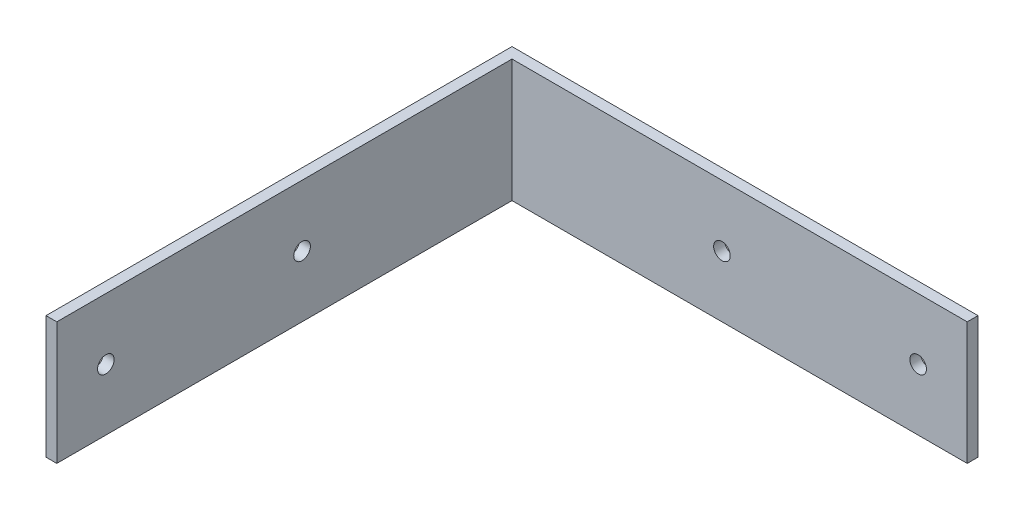
ISO-10303-21;
HEADER;
FILE_DESCRIPTION(('STEP AP214'),'2;1');
FILE_NAME('part.step','',(''),(''),'','','');
FILE_SCHEMA(('AUTOMOTIVE_DESIGN { 1 0 10303 214 1 1 1 1 }'));
ENDSEC;
DATA;
#1=APPLICATION_CONTEXT('core data for automotive mechanical design processes');
#2=APPLICATION_PROTOCOL_DEFINITION('international standard','automotive_design',2000,#1);
#3=PRODUCT_CONTEXT('',#1,'mechanical');
#4=PRODUCT('Part','Part','',(#3));
#5=PRODUCT_RELATED_PRODUCT_CATEGORY('part','',(#4));
#6=PRODUCT_DEFINITION_FORMATION('','',#4);
#7=PRODUCT_DEFINITION_CONTEXT('part definition',#1,'design');
#8=PRODUCT_DEFINITION('design','',#6,#7);
#9=PRODUCT_DEFINITION_SHAPE('','',#8);
#10=(LENGTH_UNIT() NAMED_UNIT(*) SI_UNIT(.MILLI.,.METRE.));
#11=(NAMED_UNIT(*) PLANE_ANGLE_UNIT() SI_UNIT($,.RADIAN.));
#12=(NAMED_UNIT(*) SI_UNIT($,.STERADIAN.) SOLID_ANGLE_UNIT());
#13=UNCERTAINTY_MEASURE_WITH_UNIT(LENGTH_MEASURE(1.E-05),#10,'distance_accuracy_value','');
#14=(GEOMETRIC_REPRESENTATION_CONTEXT(3) GLOBAL_UNCERTAINTY_ASSIGNED_CONTEXT((#13)) GLOBAL_UNIT_ASSIGNED_CONTEXT((#10,
#11,#12)) REPRESENTATION_CONTEXT('',''));
#15=CARTESIAN_POINT('',(0.,0.,0.));
#16=DIRECTION('',(0.,0.,1.));
#17=DIRECTION('',(1.,0.,0.));
#18=AXIS2_PLACEMENT_3D('',#15,#16,#17);
#19=CARTESIAN_POINT('',(120.65,31.75,0.));
#20=DIRECTION('',(-1.,0.,0.));
#21=DIRECTION('',(0.,0.,1.));
#22=AXIS2_PLACEMENT_3D('',#19,#20,#21);
#23=PLANE('',#22);
#24=DIRECTION('',(0.,0.,-1.));
#25=VECTOR('',#24,1.);
#26=CARTESIAN_POINT('',(120.65,0.,0.));
#27=LINE('',#26,#25);
#28=CARTESIAN_POINT('',(120.65,0.,2.794));
#29=VERTEX_POINT('',#28);
#30=CARTESIAN_POINT('',(120.65,0.,0.));
#31=VERTEX_POINT('',#30);
#32=EDGE_CURVE('E142',#29,#31,#27,.T.);
#33=ORIENTED_EDGE('',*,*,#32,.T.);
#34=DIRECTION('',(0.,-1.,0.));
#35=VECTOR('',#34,1.);
#36=CARTESIAN_POINT('',(120.65,31.75,0.));
#37=LINE('',#36,#35);
#38=CARTESIAN_POINT('',(120.65,31.75,0.));
#39=VERTEX_POINT('',#38);
#40=EDGE_CURVE('E11',#39,#31,#37,.T.);
#41=ORIENTED_EDGE('',*,*,#40,.F.);
#42=DIRECTION('',(0.,0.,-1.));
#43=VECTOR('',#42,1.);
#44=CARTESIAN_POINT('',(120.65,31.75,0.));
#45=LINE('',#44,#43);
#46=CARTESIAN_POINT('',(120.65,31.75,2.794));
#47=VERTEX_POINT('',#46);
#48=EDGE_CURVE('E159',#47,#39,#45,.T.);
#49=ORIENTED_EDGE('',*,*,#48,.F.);
#50=DIRECTION('',(0.,-1.,0.));
#51=VECTOR('',#50,1.);
#52=CARTESIAN_POINT('',(120.65,31.75,2.794));
#53=LINE('',#52,#51);
#54=EDGE_CURVE('E138',#47,#29,#53,.T.);
#55=ORIENTED_EDGE('',*,*,#54,.T.);
#56=EDGE_LOOP('',(#33,#41,#49,#55));
#57=FACE_BOUND('',#56,.T.);
#58=ADVANCED_FACE('F38',(#57),#23,.F.);
#59=CARTESIAN_POINT('',(0.,31.75,0.));
#60=DIRECTION('',(0.,0.,1.));
#61=DIRECTION('',(1.,0.,0.));
#62=AXIS2_PLACEMENT_3D('',#59,#60,#61);
#63=PLANE('',#62);
#64=CARTESIAN_POINT('',(107.95,15.875,0.));
#65=DIRECTION('',(0.,0.,-1.));
#66=DIRECTION('',(-1.,0.,0.));
#67=AXIS2_PLACEMENT_3D('',#64,#65,#66);
#68=CIRCLE('',#67,2.15264999999999);
#69=CARTESIAN_POINT('',(105.79735,15.875,0.));
#70=VERTEX_POINT('',#69);
#71=EDGE_CURVE('E328',#70,#70,#68,.T.);
#72=ORIENTED_EDGE('',*,*,#71,.F.);
#73=EDGE_LOOP('',(#72));
#74=FACE_BOUND('',#73,.T.);
#75=CARTESIAN_POINT('',(57.15,15.875,0.));
#76=DIRECTION('',(0.,0.,-1.));
#77=DIRECTION('',(-1.,0.,0.));
#78=AXIS2_PLACEMENT_3D('',#75,#76,#77);
#79=CIRCLE('',#78,2.15265);
#80=CARTESIAN_POINT('',(54.99735,15.875,0.));
#81=VERTEX_POINT('',#80);
#82=EDGE_CURVE('E299',#81,#81,#79,.T.);
#83=ORIENTED_EDGE('',*,*,#82,.F.);
#84=EDGE_LOOP('',(#83));
#85=FACE_BOUND('',#84,.T.);
#86=DIRECTION('',(-1.,0.,0.));
#87=VECTOR('',#86,1.);
#88=CARTESIAN_POINT('',(0.,0.,0.));
#89=LINE('',#88,#87);
#90=CARTESIAN_POINT('',(0.,0.,0.));
#91=VERTEX_POINT('',#90);
#92=EDGE_CURVE('E146',#31,#91,#89,.T.);
#93=ORIENTED_EDGE('',*,*,#92,.T.);
#94=DIRECTION('',(0.,-1.,0.));
#95=VECTOR('',#94,1.);
#96=CARTESIAN_POINT('',(0.,31.75,0.));
#97=LINE('',#96,#95);
#98=CARTESIAN_POINT('',(0.,31.75,0.));
#99=VERTEX_POINT('',#98);
#100=EDGE_CURVE('E48',#99,#91,#97,.T.);
#101=ORIENTED_EDGE('',*,*,#100,.F.);
#102=DIRECTION('',(-1.,0.,0.));
#103=VECTOR('',#102,1.);
#104=CARTESIAN_POINT('',(0.,31.75,0.));
#105=LINE('',#104,#103);
#106=EDGE_CURVE('E102',#39,#99,#105,.T.);
#107=ORIENTED_EDGE('',*,*,#106,.F.);
#108=ORIENTED_EDGE('',*,*,#40,.T.);
#109=EDGE_LOOP('',(#93,#101,#107,#108));
#110=FACE_BOUND('',#109,.T.);
#111=ADVANCED_FACE('F191',(#74,#85,#110),#63,.F.);
#112=CARTESIAN_POINT('',(0.,31.75,0.));
#113=DIRECTION('',(1.,0.,0.));
#114=DIRECTION('',(0.,0.,-1.));
#115=AXIS2_PLACEMENT_3D('',#112,#113,#114);
#116=PLANE('',#115);
#117=CARTESIAN_POINT('',(0.,15.875,107.95));
#118=DIRECTION('',(-1.,0.,0.));
#119=DIRECTION('',(0.,0.,1.));
#120=AXIS2_PLACEMENT_3D('',#117,#118,#119);
#121=CIRCLE('',#120,2.15264999999999);
#122=CARTESIAN_POINT('',(0.,15.875,110.10265));
#123=VERTEX_POINT('',#122);
#124=EDGE_CURVE('E312',#123,#123,#121,.T.);
#125=ORIENTED_EDGE('',*,*,#124,.F.);
#126=EDGE_LOOP('',(#125));
#127=FACE_BOUND('',#126,.T.);
#128=CARTESIAN_POINT('',(0.,15.875,57.15));
#129=DIRECTION('',(-1.,0.,0.));
#130=DIRECTION('',(0.,0.,1.));
#131=AXIS2_PLACEMENT_3D('',#128,#129,#130);
#132=CIRCLE('',#131,2.15264999999999);
#133=CARTESIAN_POINT('',(0.,15.875,59.30265));
#134=VERTEX_POINT('',#133);
#135=EDGE_CURVE('E318',#134,#134,#132,.T.);
#136=ORIENTED_EDGE('',*,*,#135,.F.);
#137=EDGE_LOOP('',(#136));
#138=FACE_BOUND('',#137,.T.);
#139=DIRECTION('',(0.,0.,1.));
#140=VECTOR('',#139,1.);
#141=CARTESIAN_POINT('',(0.,0.,0.));
#142=LINE('',#141,#140);
#143=CARTESIAN_POINT('',(0.,0.,120.65));
#144=VERTEX_POINT('',#143);
#145=EDGE_CURVE('E150',#91,#144,#142,.T.);
#146=ORIENTED_EDGE('',*,*,#145,.T.);
#147=DIRECTION('',(0.,-1.,0.));
#148=VECTOR('',#147,1.);
#149=CARTESIAN_POINT('',(0.,31.75,120.65));
#150=LINE('',#149,#148);
#151=CARTESIAN_POINT('',(0.,31.75,120.65));
#152=VERTEX_POINT('',#151);
#153=EDGE_CURVE('E129',#152,#144,#150,.T.);
#154=ORIENTED_EDGE('',*,*,#153,.F.);
#155=DIRECTION('',(0.,0.,1.));
#156=VECTOR('',#155,1.);
#157=CARTESIAN_POINT('',(0.,31.75,0.));
#158=LINE('',#157,#156);
#159=EDGE_CURVE('E118',#99,#152,#158,.T.);
#160=ORIENTED_EDGE('',*,*,#159,.F.);
#161=ORIENTED_EDGE('',*,*,#100,.T.);
#162=EDGE_LOOP('',(#146,#154,#160,#161));
#163=FACE_BOUND('',#162,.T.);
#164=ADVANCED_FACE('F169',(#127,#138,#163),#116,.F.);
#165=CARTESIAN_POINT('',(0.,31.75,120.65));
#166=DIRECTION('',(0.,0.,-1.));
#167=DIRECTION('',(-1.,0.,0.));
#168=AXIS2_PLACEMENT_3D('',#165,#166,#167);
#169=PLANE('',#168);
#170=DIRECTION('',(1.,0.,0.));
#171=VECTOR('',#170,1.);
#172=CARTESIAN_POINT('',(0.,0.,120.65));
#173=LINE('',#172,#171);
#174=CARTESIAN_POINT('',(2.79400000000001,0.,120.65));
#175=VERTEX_POINT('',#174);
#176=EDGE_CURVE('E127',#144,#175,#173,.T.);
#177=ORIENTED_EDGE('',*,*,#176,.T.);
#178=DIRECTION('',(0.,-1.,0.));
#179=VECTOR('',#178,1.);
#180=CARTESIAN_POINT('',(2.79400000000001,31.75,120.65));
#181=LINE('',#180,#179);
#182=CARTESIAN_POINT('',(2.79400000000001,31.75,120.65));
#183=VERTEX_POINT('',#182);
#184=EDGE_CURVE('E124',#183,#175,#181,.T.);
#185=ORIENTED_EDGE('',*,*,#184,.F.);
#186=DIRECTION('',(1.,0.,0.));
#187=VECTOR('',#186,1.);
#188=CARTESIAN_POINT('',(0.,31.75,120.65));
#189=LINE('',#188,#187);
#190=EDGE_CURVE('E112',#152,#183,#189,.T.);
#191=ORIENTED_EDGE('',*,*,#190,.F.);
#192=ORIENTED_EDGE('',*,*,#153,.T.);
#193=EDGE_LOOP('',(#177,#185,#191,#192));
#194=FACE_BOUND('',#193,.T.);
#195=ADVANCED_FACE('F125',(#194),#169,.F.);
#196=CARTESIAN_POINT('',(2.794,31.75,2.794));
#197=DIRECTION('',(-1.,0.,0.));
#198=DIRECTION('',(0.,0.,1.));
#199=AXIS2_PLACEMENT_3D('',#196,#197,#198);
#200=PLANE('',#199);
#201=CARTESIAN_POINT('',(2.79400000000001,15.875,107.95));
#202=DIRECTION('',(-1.,0.,0.));
#203=DIRECTION('',(0.,0.,1.));
#204=AXIS2_PLACEMENT_3D('',#201,#202,#203);
#205=CIRCLE('',#204,2.15264999999999);
#206=CARTESIAN_POINT('',(2.79400000000001,15.875,110.10265));
#207=VERTEX_POINT('',#206);
#208=EDGE_CURVE('E315',#207,#207,#205,.T.);
#209=ORIENTED_EDGE('',*,*,#208,.T.);
#210=EDGE_LOOP('',(#209));
#211=FACE_BOUND('',#210,.T.);
#212=CARTESIAN_POINT('',(2.794,15.875,57.15));
#213=DIRECTION('',(-1.,0.,0.));
#214=DIRECTION('',(0.,0.,1.));
#215=AXIS2_PLACEMENT_3D('',#212,#213,#214);
#216=CIRCLE('',#215,2.15264999999999);
#217=CARTESIAN_POINT('',(2.794,15.875,59.30265));
#218=VERTEX_POINT('',#217);
#219=EDGE_CURVE('E323',#218,#218,#216,.T.);
#220=ORIENTED_EDGE('',*,*,#219,.T.);
#221=EDGE_LOOP('',(#220));
#222=FACE_BOUND('',#221,.T.);
#223=DIRECTION('',(0.,0.,-1.));
#224=VECTOR('',#223,1.);
#225=CARTESIAN_POINT('',(2.794,0.,2.794));
#226=LINE('',#225,#224);
#227=CARTESIAN_POINT('',(2.794,0.,2.794));
#228=VERTEX_POINT('',#227);
#229=EDGE_CURVE('E87',#175,#228,#226,.T.);
#230=ORIENTED_EDGE('',*,*,#229,.T.);
#231=DIRECTION('',(0.,-1.,0.));
#232=VECTOR('',#231,1.);
#233=CARTESIAN_POINT('',(2.794,31.75,2.794));
#234=LINE('',#233,#232);
#235=CARTESIAN_POINT('',(2.794,31.75,2.794));
#236=VERTEX_POINT('',#235);
#237=EDGE_CURVE('E130',#236,#228,#234,.T.);
#238=ORIENTED_EDGE('',*,*,#237,.F.);
#239=DIRECTION('',(0.,0.,-1.));
#240=VECTOR('',#239,1.);
#241=CARTESIAN_POINT('',(2.794,31.75,2.794));
#242=LINE('',#241,#240);
#243=EDGE_CURVE('E116',#183,#236,#242,.T.);
#244=ORIENTED_EDGE('',*,*,#243,.F.);
#245=ORIENTED_EDGE('',*,*,#184,.T.);
#246=EDGE_LOOP('',(#230,#238,#244,#245));
#247=FACE_BOUND('',#246,.T.);
#248=ADVANCED_FACE('F132',(#211,#222,#247),#200,.F.);
#249=CARTESIAN_POINT('',(2.794,31.75,2.794));
#250=DIRECTION('',(0.,0.,-1.));
#251=DIRECTION('',(-1.,0.,0.));
#252=AXIS2_PLACEMENT_3D('',#249,#250,#251);
#253=PLANE('',#252);
#254=CARTESIAN_POINT('',(107.95,15.875,2.794));
#255=DIRECTION('',(0.,0.,-1.));
#256=DIRECTION('',(-1.,0.,0.));
#257=AXIS2_PLACEMENT_3D('',#254,#255,#256);
#258=CIRCLE('',#257,2.15264999999999);
#259=CARTESIAN_POINT('',(105.79735,15.875,2.794));
#260=VERTEX_POINT('',#259);
#261=EDGE_CURVE('E41',#260,#260,#258,.T.);
#262=ORIENTED_EDGE('',*,*,#261,.T.);
#263=EDGE_LOOP('',(#262));
#264=FACE_BOUND('',#263,.T.);
#265=CARTESIAN_POINT('',(57.15,15.875,2.794));
#266=DIRECTION('',(0.,0.,-1.));
#267=DIRECTION('',(-1.,0.,0.));
#268=AXIS2_PLACEMENT_3D('',#265,#266,#267);
#269=CIRCLE('',#268,2.15265);
#270=CARTESIAN_POINT('',(54.99735,15.875,2.794));
#271=VERTEX_POINT('',#270);
#272=EDGE_CURVE('E147',#271,#271,#269,.T.);
#273=ORIENTED_EDGE('',*,*,#272,.T.);
#274=EDGE_LOOP('',(#273));
#275=FACE_BOUND('',#274,.T.);
#276=DIRECTION('',(1.,0.,0.));
#277=VECTOR('',#276,1.);
#278=CARTESIAN_POINT('',(2.794,0.,2.794));
#279=LINE('',#278,#277);
#280=EDGE_CURVE('E94',#228,#29,#279,.T.);
#281=ORIENTED_EDGE('',*,*,#280,.T.);
#282=ORIENTED_EDGE('',*,*,#54,.F.);
#283=DIRECTION('',(1.,0.,0.));
#284=VECTOR('',#283,1.);
#285=CARTESIAN_POINT('',(2.794,31.75,2.794));
#286=LINE('',#285,#284);
#287=EDGE_CURVE('E59',#236,#47,#286,.T.);
#288=ORIENTED_EDGE('',*,*,#287,.F.);
#289=ORIENTED_EDGE('',*,*,#237,.T.);
#290=EDGE_LOOP('',(#281,#282,#288,#289));
#291=FACE_BOUND('',#290,.T.);
#292=ADVANCED_FACE('F176',(#264,#275,#291),#253,.F.);
#293=CARTESIAN_POINT('',(0.,31.75,0.));
#294=DIRECTION('',(0.,1.,0.));
#295=DIRECTION('',(0.,0.,1.));
#296=AXIS2_PLACEMENT_3D('',#293,#294,#295);
#297=PLANE('',#296);
#298=ORIENTED_EDGE('',*,*,#48,.T.);
#299=ORIENTED_EDGE('',*,*,#106,.T.);
#300=ORIENTED_EDGE('',*,*,#159,.T.);
#301=ORIENTED_EDGE('',*,*,#190,.T.);
#302=ORIENTED_EDGE('',*,*,#243,.T.);
#303=ORIENTED_EDGE('',*,*,#287,.T.);
#304=EDGE_LOOP('',(#298,#299,#300,#301,#302,#303));
#305=FACE_BOUND('',#304,.T.);
#306=ADVANCED_FACE('F114',(#305),#297,.T.);
#307=CARTESIAN_POINT('',(0.,0.,0.));
#308=DIRECTION('',(0.,1.,0.));
#309=DIRECTION('',(0.,0.,1.));
#310=AXIS2_PLACEMENT_3D('',#307,#308,#309);
#311=PLANE('',#310);
#312=ORIENTED_EDGE('',*,*,#32,.F.);
#313=ORIENTED_EDGE('',*,*,#280,.F.);
#314=ORIENTED_EDGE('',*,*,#229,.F.);
#315=ORIENTED_EDGE('',*,*,#176,.F.);
#316=ORIENTED_EDGE('',*,*,#145,.F.);
#317=ORIENTED_EDGE('',*,*,#92,.F.);
#318=EDGE_LOOP('',(#312,#313,#314,#315,#316,#317));
#319=FACE_BOUND('',#318,.T.);
#320=ADVANCED_FACE('F172',(#319),#311,.F.);
#321=CARTESIAN_POINT('',(57.15,15.875,0.));
#322=DIRECTION('',(0.,0.,-1.));
#323=DIRECTION('',(-1.,0.,0.));
#324=AXIS2_PLACEMENT_3D('',#321,#322,#323);
#325=CYLINDRICAL_SURFACE('',#324,2.15265);
#326=ORIENTED_EDGE('',*,*,#82,.T.);
#327=EDGE_LOOP('',(#326));
#328=FACE_BOUND('',#327,.T.);
#329=ORIENTED_EDGE('',*,*,#272,.F.);
#330=EDGE_LOOP('',(#329));
#331=FACE_BOUND('',#330,.T.);
#332=ADVANCED_FACE('F223',(#328,#331),#325,.F.);
#333=CARTESIAN_POINT('',(107.95,15.875,0.));
#334=DIRECTION('',(0.,0.,-1.));
#335=DIRECTION('',(-1.,0.,0.));
#336=AXIS2_PLACEMENT_3D('',#333,#334,#335);
#337=CYLINDRICAL_SURFACE('',#336,2.15264999999999);
#338=ORIENTED_EDGE('',*,*,#71,.T.);
#339=EDGE_LOOP('',(#338));
#340=FACE_BOUND('',#339,.T.);
#341=ORIENTED_EDGE('',*,*,#261,.F.);
#342=EDGE_LOOP('',(#341));
#343=FACE_BOUND('',#342,.T.);
#344=ADVANCED_FACE('F233',(#340,#343),#337,.F.);
#345=CARTESIAN_POINT('',(0.,15.875,57.15));
#346=DIRECTION('',(-1.,0.,0.));
#347=DIRECTION('',(0.,0.,1.));
#348=AXIS2_PLACEMENT_3D('',#345,#346,#347);
#349=CYLINDRICAL_SURFACE('',#348,2.15264999999999);
#350=ORIENTED_EDGE('',*,*,#135,.T.);
#351=EDGE_LOOP('',(#350));
#352=FACE_BOUND('',#351,.T.);
#353=ORIENTED_EDGE('',*,*,#219,.F.);
#354=EDGE_LOOP('',(#353));
#355=FACE_BOUND('',#354,.T.);
#356=ADVANCED_FACE('F237',(#352,#355),#349,.F.);
#357=CARTESIAN_POINT('',(0.,15.875,107.95));
#358=DIRECTION('',(-1.,0.,0.));
#359=DIRECTION('',(0.,0.,1.));
#360=AXIS2_PLACEMENT_3D('',#357,#358,#359);
#361=CYLINDRICAL_SURFACE('',#360,2.15264999999999);
#362=ORIENTED_EDGE('',*,*,#124,.T.);
#363=EDGE_LOOP('',(#362));
#364=FACE_BOUND('',#363,.T.);
#365=ORIENTED_EDGE('',*,*,#208,.F.);
#366=EDGE_LOOP('',(#365));
#367=FACE_BOUND('',#366,.T.);
#368=ADVANCED_FACE('F245',(#364,#367),#361,.F.);
#369=CLOSED_SHELL('',(#58,#111,#164,#195,#248,#292,#306,#320,#332,#344,#356,#368));
#370=MANIFOLD_SOLID_BREP('B2',#369);
#371=ADVANCED_BREP_SHAPE_REPRESENTATION('',(#18,#370),#14);
#372=SHAPE_DEFINITION_REPRESENTATION(#9,#371);
ENDSEC;
END-ISO-10303-21;
